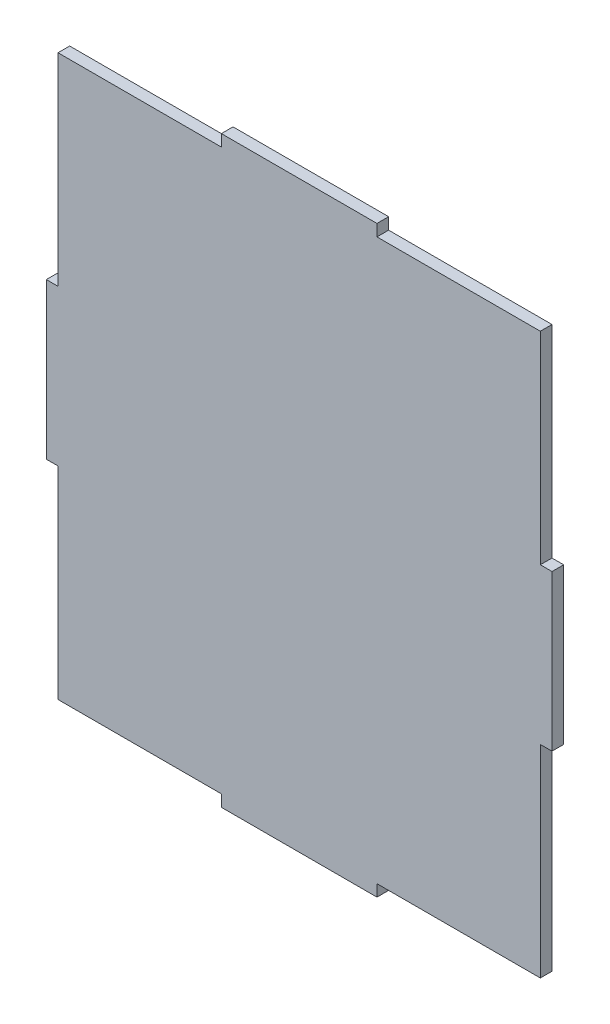
ISO-10303-21;
HEADER;
FILE_DESCRIPTION(('STEP AP214'),'2;1');
FILE_NAME('part.step','',(''),(''),'','','');
FILE_SCHEMA(('AUTOMOTIVE_DESIGN { 1 0 10303 214 1 1 1 1 }'));
ENDSEC;
DATA;
#1=APPLICATION_CONTEXT('core data for automotive mechanical design processes');
#2=APPLICATION_PROTOCOL_DEFINITION('international standard','automotive_design',2000,#1);
#3=PRODUCT_CONTEXT('',#1,'mechanical');
#4=PRODUCT('Part','Part','',(#3));
#5=PRODUCT_RELATED_PRODUCT_CATEGORY('part','',(#4));
#6=PRODUCT_DEFINITION_FORMATION('','',#4);
#7=PRODUCT_DEFINITION_CONTEXT('part definition',#1,'design');
#8=PRODUCT_DEFINITION('design','',#6,#7);
#9=PRODUCT_DEFINITION_SHAPE('','',#8);
#10=(LENGTH_UNIT() NAMED_UNIT(*) SI_UNIT(.MILLI.,.METRE.));
#11=(NAMED_UNIT(*) PLANE_ANGLE_UNIT() SI_UNIT($,.RADIAN.));
#12=(NAMED_UNIT(*) SI_UNIT($,.STERADIAN.) SOLID_ANGLE_UNIT());
#13=UNCERTAINTY_MEASURE_WITH_UNIT(LENGTH_MEASURE(1.E-05),#10,'distance_accuracy_value','');
#14=(GEOMETRIC_REPRESENTATION_CONTEXT(3) GLOBAL_UNCERTAINTY_ASSIGNED_CONTEXT((#13)) GLOBAL_UNIT_ASSIGNED_CONTEXT((#10,
#11,#12)) REPRESENTATION_CONTEXT('',''));
#15=CARTESIAN_POINT('',(0.,0.,0.));
#16=DIRECTION('',(0.,0.,1.));
#17=DIRECTION('',(1.,0.,0.));
#18=AXIS2_PLACEMENT_3D('',#15,#16,#17);
#19=CARTESIAN_POINT('',(0.,0.,0.));
#20=DIRECTION('',(0.,0.,1.));
#21=DIRECTION('',(1.,0.,0.));
#22=AXIS2_PLACEMENT_3D('',#19,#20,#21);
#23=PLANE('',#22);
#24=DIRECTION('',(0.,-1.,0.));
#25=VECTOR('',#24,1.);
#26=CARTESIAN_POINT('',(63.5465250617138,0.,0.));
#27=LINE('',#26,#25);
#28=CARTESIAN_POINT('',(63.5465250617138,66.844916460954,0.));
#29=VERTEX_POINT('',#28);
#30=CARTESIAN_POINT('',(63.5465250617138,14.844916460954,0.));
#31=VERTEX_POINT('',#30);
#32=EDGE_CURVE('E392',#29,#31,#27,.T.);
#33=ORIENTED_EDGE('',*,*,#32,.T.);
#34=DIRECTION('',(1.,0.,0.));
#35=VECTOR('',#34,1.);
#36=CARTESIAN_POINT('',(63.5465250617138,14.844916460954,0.));
#37=LINE('',#36,#35);
#38=CARTESIAN_POINT('',(66.5465250617138,14.844916460954,0.));
#39=VERTEX_POINT('',#38);
#40=EDGE_CURVE('E191',#31,#39,#37,.T.);
#41=ORIENTED_EDGE('',*,*,#40,.T.);
#42=DIRECTION('',(0.,-1.,0.));
#43=VECTOR('',#42,1.);
#44=CARTESIAN_POINT('',(66.5465250617138,14.844916460954,0.));
#45=LINE('',#44,#43);
#46=CARTESIAN_POINT('',(66.5465250617138,-25.155083539046,0.));
#47=VERTEX_POINT('',#46);
#48=EDGE_CURVE('E299',#39,#47,#45,.T.);
#49=ORIENTED_EDGE('',*,*,#48,.T.);
#50=DIRECTION('',(1.,0.,0.));
#51=VECTOR('',#50,1.);
#52=CARTESIAN_POINT('',(63.5465250617138,-25.155083539046,0.));
#53=LINE('',#52,#51);
#54=CARTESIAN_POINT('',(63.5465250617138,-25.155083539046,0.));
#55=VERTEX_POINT('',#54);
#56=EDGE_CURVE('E291',#55,#47,#53,.T.);
#57=ORIENTED_EDGE('',*,*,#56,.F.);
#58=CARTESIAN_POINT('',(63.5465250617138,-77.155083539046,0.));
#59=VERTEX_POINT('',#58);
#60=EDGE_CURVE('E254',#55,#59,#27,.T.);
#61=ORIENTED_EDGE('',*,*,#60,.T.);
#62=DIRECTION('',(1.,0.,0.));
#63=VECTOR('',#62,1.);
#64=CARTESIAN_POINT('',(0.,-77.155083539046,0.));
#65=LINE('',#64,#63);
#66=CARTESIAN_POINT('',(21.5465250617138,-77.155083539046,0.));
#67=VERTEX_POINT('',#66);
#68=EDGE_CURVE('E408',#67,#59,#65,.T.);
#69=ORIENTED_EDGE('',*,*,#68,.F.);
#70=DIRECTION('',(0.,1.,0.));
#71=VECTOR('',#70,1.);
#72=CARTESIAN_POINT('',(21.5465250617138,-80.155083539046,0.));
#73=LINE('',#72,#71);
#74=CARTESIAN_POINT('',(21.5465250617138,-80.155083539046,0.));
#75=VERTEX_POINT('',#74);
#76=EDGE_CURVE('E203',#75,#67,#73,.T.);
#77=ORIENTED_EDGE('',*,*,#76,.F.);
#78=DIRECTION('',(1.,0.,0.));
#79=VECTOR('',#78,1.);
#80=CARTESIAN_POINT('',(-18.4534749382862,-80.155083539046,0.));
#81=LINE('',#80,#79);
#82=CARTESIAN_POINT('',(-18.4534749382862,-80.155083539046,0.));
#83=VERTEX_POINT('',#82);
#84=EDGE_CURVE('E181',#83,#75,#81,.T.);
#85=ORIENTED_EDGE('',*,*,#84,.F.);
#86=DIRECTION('',(0.,1.,0.));
#87=VECTOR('',#86,1.);
#88=CARTESIAN_POINT('',(-18.4534749382862,-80.155083539046,0.));
#89=LINE('',#88,#87);
#90=CARTESIAN_POINT('',(-18.4534749382862,-77.155083539046,0.));
#91=VERTEX_POINT('',#90);
#92=EDGE_CURVE('E200',#83,#91,#89,.T.);
#93=ORIENTED_EDGE('',*,*,#92,.T.);
#94=CARTESIAN_POINT('',(-60.4534749382862,-77.155083539046,0.));
#95=VERTEX_POINT('',#94);
#96=EDGE_CURVE('E409',#95,#91,#65,.T.);
#97=ORIENTED_EDGE('',*,*,#96,.F.);
#98=DIRECTION('',(0.,-1.,0.));
#99=VECTOR('',#98,1.);
#100=CARTESIAN_POINT('',(-60.4534749382862,0.,0.));
#101=LINE('',#100,#99);
#102=CARTESIAN_POINT('',(-60.4534749382862,-25.155083539046,0.));
#103=VERTEX_POINT('',#102);
#104=EDGE_CURVE('E404',#103,#95,#101,.T.);
#105=ORIENTED_EDGE('',*,*,#104,.F.);
#106=DIRECTION('',(1.,0.,0.));
#107=VECTOR('',#106,1.);
#108=CARTESIAN_POINT('',(-63.4534749382862,-25.155083539046,0.));
#109=LINE('',#108,#107);
#110=CARTESIAN_POINT('',(-63.4534749382862,-25.155083539046,0.));
#111=VERTEX_POINT('',#110);
#112=EDGE_CURVE('E247',#111,#103,#109,.T.);
#113=ORIENTED_EDGE('',*,*,#112,.F.);
#114=DIRECTION('',(0.,-1.,0.));
#115=VECTOR('',#114,1.);
#116=CARTESIAN_POINT('',(-63.4534749382862,14.844916460954,0.));
#117=LINE('',#116,#115);
#118=CARTESIAN_POINT('',(-63.4534749382862,14.844916460954,0.));
#119=VERTEX_POINT('',#118);
#120=EDGE_CURVE('E238',#119,#111,#117,.T.);
#121=ORIENTED_EDGE('',*,*,#120,.F.);
#122=DIRECTION('',(1.,0.,0.));
#123=VECTOR('',#122,1.);
#124=CARTESIAN_POINT('',(-63.4534749382862,14.844916460954,0.));
#125=LINE('',#124,#123);
#126=CARTESIAN_POINT('',(-60.4534749382862,14.844916460954,0.));
#127=VERTEX_POINT('',#126);
#128=EDGE_CURVE('E244',#119,#127,#125,.T.);
#129=ORIENTED_EDGE('',*,*,#128,.T.);
#130=CARTESIAN_POINT('',(-60.4534749382862,66.844916460954,0.));
#131=VERTEX_POINT('',#130);
#132=EDGE_CURVE('E405',#131,#127,#101,.T.);
#133=ORIENTED_EDGE('',*,*,#132,.F.);
#134=DIRECTION('',(1.,0.,0.));
#135=VECTOR('',#134,1.);
#136=CARTESIAN_POINT('',(0.,66.844916460954,0.));
#137=LINE('',#136,#135);
#138=CARTESIAN_POINT('',(-18.4534749382862,66.844916460954,0.));
#139=VERTEX_POINT('',#138);
#140=EDGE_CURVE('E396',#131,#139,#137,.T.);
#141=ORIENTED_EDGE('',*,*,#140,.T.);
#142=DIRECTION('',(0.,-1.,0.));
#143=VECTOR('',#142,1.);
#144=CARTESIAN_POINT('',(-18.4534749382862,69.844916460954,0.));
#145=LINE('',#144,#143);
#146=CARTESIAN_POINT('',(-18.4534749382862,69.844916460954,0.));
#147=VERTEX_POINT('',#146);
#148=EDGE_CURVE('E271',#147,#139,#145,.T.);
#149=ORIENTED_EDGE('',*,*,#148,.F.);
#150=DIRECTION('',(1.,0.,0.));
#151=VECTOR('',#150,1.);
#152=CARTESIAN_POINT('',(-18.4534749382862,69.844916460954,0.));
#153=LINE('',#152,#151);
#154=CARTESIAN_POINT('',(21.5465250617138,69.844916460954,0.));
#155=VERTEX_POINT('',#154);
#156=EDGE_CURVE('E264',#147,#155,#153,.T.);
#157=ORIENTED_EDGE('',*,*,#156,.T.);
#158=DIRECTION('',(0.,-1.,0.));
#159=VECTOR('',#158,1.);
#160=CARTESIAN_POINT('',(21.5465250617138,69.844916460954,0.));
#161=LINE('',#160,#159);
#162=CARTESIAN_POINT('',(21.5465250617138,66.844916460954,0.));
#163=VERTEX_POINT('',#162);
#164=EDGE_CURVE('E274',#155,#163,#161,.T.);
#165=ORIENTED_EDGE('',*,*,#164,.T.);
#166=EDGE_CURVE('E393',#163,#29,#137,.T.);
#167=ORIENTED_EDGE('',*,*,#166,.T.);
#168=EDGE_LOOP('',(#33,#41,#49,#57,#61,#69,#77,#85,#93,#97,#105,#113,#121,#129,#133,#141,#149,
#157,#165,#167));
#169=FACE_BOUND('',#168,.T.);
#170=ADVANCED_FACE('F107',(#169),#23,.F.);
#171=CARTESIAN_POINT('',(-60.4534749382862,0.,3.));
#172=DIRECTION('',(1.,0.,0.));
#173=DIRECTION('',(0.,1.,0.));
#174=AXIS2_PLACEMENT_3D('',#171,#172,#173);
#175=PLANE('',#174);
#176=DIRECTION('',(0.,0.,-1.));
#177=VECTOR('',#176,1.);
#178=CARTESIAN_POINT('',(-60.4534749382862,14.844916460954,3.));
#179=LINE('',#178,#177);
#180=CARTESIAN_POINT('',(-60.4534749382862,14.844916460954,3.));
#181=VERTEX_POINT('',#180);
#182=EDGE_CURVE('E212',#181,#127,#179,.T.);
#183=ORIENTED_EDGE('',*,*,#182,.F.);
#184=DIRECTION('',(0.,-1.,0.));
#185=VECTOR('',#184,1.);
#186=CARTESIAN_POINT('',(-60.4534749382862,0.,3.));
#187=LINE('',#186,#185);
#188=CARTESIAN_POINT('',(-60.4534749382862,66.844916460954,3.));
#189=VERTEX_POINT('',#188);
#190=EDGE_CURVE('E447',#189,#181,#187,.T.);
#191=ORIENTED_EDGE('',*,*,#190,.F.);
#192=DIRECTION('',(0.,0.,-1.));
#193=VECTOR('',#192,1.);
#194=CARTESIAN_POINT('',(-60.4534749382862,66.844916460954,3.));
#195=LINE('',#194,#193);
#196=EDGE_CURVE('E222',#189,#131,#195,.T.);
#197=ORIENTED_EDGE('',*,*,#196,.T.);
#198=ORIENTED_EDGE('',*,*,#132,.T.);
#199=EDGE_LOOP('',(#183,#191,#197,#198));
#200=FACE_BOUND('',#199,.T.);
#201=ADVANCED_FACE('F324',(#200),#175,.F.);
#202=CARTESIAN_POINT('',(-60.4534749382862,-25.155083539046,3.));
#203=VERTEX_POINT('',#202);
#204=CARTESIAN_POINT('',(-60.4534749382862,-77.155083539046,3.));
#205=VERTEX_POINT('',#204);
#206=EDGE_CURVE('E435',#203,#205,#187,.T.);
#207=ORIENTED_EDGE('',*,*,#206,.F.);
#208=DIRECTION('',(0.,0.,-1.));
#209=VECTOR('',#208,1.);
#210=CARTESIAN_POINT('',(-60.4534749382862,-25.155083539046,3.));
#211=LINE('',#210,#209);
#212=EDGE_CURVE('E218',#203,#103,#211,.T.);
#213=ORIENTED_EDGE('',*,*,#212,.T.);
#214=ORIENTED_EDGE('',*,*,#104,.T.);
#215=DIRECTION('',(0.,0.,-1.));
#216=VECTOR('',#215,1.);
#217=CARTESIAN_POINT('',(-60.4534749382862,-77.155083539046,3.));
#218=LINE('',#217,#216);
#219=EDGE_CURVE('E230',#205,#95,#218,.T.);
#220=ORIENTED_EDGE('',*,*,#219,.F.);
#221=EDGE_LOOP('',(#207,#213,#214,#220));
#222=FACE_BOUND('',#221,.T.);
#223=ADVANCED_FACE('F326',(#222),#175,.F.);
#224=CARTESIAN_POINT('',(0.,-77.155083539046,3.));
#225=DIRECTION('',(0.,1.,0.));
#226=DIRECTION('',(0.,0.,1.));
#227=AXIS2_PLACEMENT_3D('',#224,#225,#226);
#228=PLANE('',#227);
#229=DIRECTION('',(1.,0.,0.));
#230=VECTOR('',#229,1.);
#231=CARTESIAN_POINT('',(0.,-77.155083539046,3.));
#232=LINE('',#231,#230);
#233=CARTESIAN_POINT('',(21.5465250617138,-77.155083539046,3.));
#234=VERTEX_POINT('',#233);
#235=CARTESIAN_POINT('',(63.5465250617138,-77.155083539046,3.));
#236=VERTEX_POINT('',#235);
#237=EDGE_CURVE('E486',#234,#236,#232,.T.);
#238=ORIENTED_EDGE('',*,*,#237,.F.);
#239=DIRECTION('',(0.,0.,-1.));
#240=VECTOR('',#239,1.);
#241=CARTESIAN_POINT('',(21.5465250617138,-77.155083539046,3.));
#242=LINE('',#241,#240);
#243=EDGE_CURVE('E126',#234,#67,#242,.T.);
#244=ORIENTED_EDGE('',*,*,#243,.T.);
#245=ORIENTED_EDGE('',*,*,#68,.T.);
#246=DIRECTION('',(0.,0.,-1.));
#247=VECTOR('',#246,1.);
#248=CARTESIAN_POINT('',(63.5465250617138,-77.155083539046,3.));
#249=LINE('',#248,#247);
#250=EDGE_CURVE('E412',#236,#59,#249,.T.);
#251=ORIENTED_EDGE('',*,*,#250,.F.);
#252=EDGE_LOOP('',(#238,#244,#245,#251));
#253=FACE_BOUND('',#252,.T.);
#254=ADVANCED_FACE('F321',(#253),#228,.F.);
#255=CARTESIAN_POINT('',(63.5465250617138,0.,3.));
#256=DIRECTION('',(1.,0.,0.));
#257=DIRECTION('',(0.,1.,0.));
#258=AXIS2_PLACEMENT_3D('',#255,#256,#257);
#259=PLANE('',#258);
#260=DIRECTION('',(0.,0.,-1.));
#261=VECTOR('',#260,1.);
#262=CARTESIAN_POINT('',(63.5465250617138,-25.155083539046,3.));
#263=LINE('',#262,#261);
#264=CARTESIAN_POINT('',(63.5465250617138,-25.155083539046,3.));
#265=VERTEX_POINT('',#264);
#266=EDGE_CURVE('E117',#265,#55,#263,.T.);
#267=ORIENTED_EDGE('',*,*,#266,.F.);
#268=DIRECTION('',(0.,-1.,0.));
#269=VECTOR('',#268,1.);
#270=CARTESIAN_POINT('',(63.5465250617138,0.,3.));
#271=LINE('',#270,#269);
#272=EDGE_CURVE('E411',#265,#236,#271,.T.);
#273=ORIENTED_EDGE('',*,*,#272,.T.);
#274=ORIENTED_EDGE('',*,*,#250,.T.);
#275=ORIENTED_EDGE('',*,*,#60,.F.);
#276=EDGE_LOOP('',(#267,#273,#274,#275));
#277=FACE_BOUND('',#276,.T.);
#278=ADVANCED_FACE('F343',(#277),#259,.T.);
#279=CARTESIAN_POINT('',(0.,66.844916460954,3.));
#280=DIRECTION('',(0.,1.,0.));
#281=DIRECTION('',(0.,0.,1.));
#282=AXIS2_PLACEMENT_3D('',#279,#280,#281);
#283=PLANE('',#282);
#284=DIRECTION('',(0.,0.,-1.));
#285=VECTOR('',#284,1.);
#286=CARTESIAN_POINT('',(21.5465250617138,66.844916460954,3.));
#287=LINE('',#286,#285);
#288=CARTESIAN_POINT('',(21.5465250617138,66.844916460954,3.));
#289=VERTEX_POINT('',#288);
#290=EDGE_CURVE('E282',#289,#163,#287,.T.);
#291=ORIENTED_EDGE('',*,*,#290,.F.);
#292=DIRECTION('',(1.,0.,0.));
#293=VECTOR('',#292,1.);
#294=CARTESIAN_POINT('',(0.,66.844916460954,3.));
#295=LINE('',#294,#293);
#296=CARTESIAN_POINT('',(63.5465250617138,66.844916460954,3.));
#297=VERTEX_POINT('',#296);
#298=EDGE_CURVE('E476',#289,#297,#295,.T.);
#299=ORIENTED_EDGE('',*,*,#298,.T.);
#300=DIRECTION('',(0.,0.,-1.));
#301=VECTOR('',#300,1.);
#302=CARTESIAN_POINT('',(63.5465250617138,66.844916460954,3.));
#303=LINE('',#302,#301);
#304=EDGE_CURVE('E220',#297,#29,#303,.T.);
#305=ORIENTED_EDGE('',*,*,#304,.T.);
#306=ORIENTED_EDGE('',*,*,#166,.F.);
#307=EDGE_LOOP('',(#291,#299,#305,#306));
#308=FACE_BOUND('',#307,.T.);
#309=ADVANCED_FACE('F339',(#308),#283,.T.);
#310=CARTESIAN_POINT('',(-18.4534749382862,66.844916460954,3.));
#311=VERTEX_POINT('',#310);
#312=EDGE_CURVE('E478',#189,#311,#295,.T.);
#313=ORIENTED_EDGE('',*,*,#312,.T.);
#314=DIRECTION('',(0.,0.,-1.));
#315=VECTOR('',#314,1.);
#316=CARTESIAN_POINT('',(-18.4534749382862,66.844916460954,3.));
#317=LINE('',#316,#315);
#318=EDGE_CURVE('E258',#311,#139,#317,.T.);
#319=ORIENTED_EDGE('',*,*,#318,.T.);
#320=ORIENTED_EDGE('',*,*,#140,.F.);
#321=ORIENTED_EDGE('',*,*,#196,.F.);
#322=EDGE_LOOP('',(#313,#319,#320,#321));
#323=FACE_BOUND('',#322,.T.);
#324=ADVANCED_FACE('F342',(#323),#283,.T.);
#325=DIRECTION('',(0.,0.,-1.));
#326=VECTOR('',#325,1.);
#327=CARTESIAN_POINT('',(-18.4534749382862,-77.155083539046,3.));
#328=LINE('',#327,#326);
#329=CARTESIAN_POINT('',(-18.4534749382862,-77.155083539046,3.));
#330=VERTEX_POINT('',#329);
#331=EDGE_CURVE('E111',#330,#91,#328,.T.);
#332=ORIENTED_EDGE('',*,*,#331,.F.);
#333=EDGE_CURVE('E400',#205,#330,#232,.T.);
#334=ORIENTED_EDGE('',*,*,#333,.F.);
#335=ORIENTED_EDGE('',*,*,#219,.T.);
#336=ORIENTED_EDGE('',*,*,#96,.T.);
#337=EDGE_LOOP('',(#332,#334,#335,#336));
#338=FACE_BOUND('',#337,.T.);
#339=ADVANCED_FACE('F419',(#338),#228,.F.);
#340=CARTESIAN_POINT('',(63.5465250617138,14.844916460954,3.));
#341=VERTEX_POINT('',#340);
#342=EDGE_CURVE('E479',#297,#341,#271,.T.);
#343=ORIENTED_EDGE('',*,*,#342,.T.);
#344=DIRECTION('',(0.,0.,-1.));
#345=VECTOR('',#344,1.);
#346=CARTESIAN_POINT('',(63.5465250617138,14.844916460954,3.));
#347=LINE('',#346,#345);
#348=EDGE_CURVE('E12',#341,#31,#347,.T.);
#349=ORIENTED_EDGE('',*,*,#348,.T.);
#350=ORIENTED_EDGE('',*,*,#32,.F.);
#351=ORIENTED_EDGE('',*,*,#304,.F.);
#352=EDGE_LOOP('',(#343,#349,#350,#351));
#353=FACE_BOUND('',#352,.T.);
#354=ADVANCED_FACE('F349',(#353),#259,.T.);
#355=CARTESIAN_POINT('',(0.,0.,3.));
#356=DIRECTION('',(0.,0.,1.));
#357=DIRECTION('',(1.,0.,0.));
#358=AXIS2_PLACEMENT_3D('',#355,#356,#357);
#359=PLANE('',#358);
#360=ORIENTED_EDGE('',*,*,#342,.F.);
#361=ORIENTED_EDGE('',*,*,#298,.F.);
#362=DIRECTION('',(0.,-1.,0.));
#363=VECTOR('',#362,1.);
#364=CARTESIAN_POINT('',(21.5465250617138,69.844916460954,3.));
#365=LINE('',#364,#363);
#366=CARTESIAN_POINT('',(21.5465250617138,69.844916460954,3.));
#367=VERTEX_POINT('',#366);
#368=EDGE_CURVE('E263',#367,#289,#365,.T.);
#369=ORIENTED_EDGE('',*,*,#368,.F.);
#370=DIRECTION('',(1.,0.,0.));
#371=VECTOR('',#370,1.);
#372=CARTESIAN_POINT('',(-18.4534749382862,69.844916460954,3.));
#373=LINE('',#372,#371);
#374=CARTESIAN_POINT('',(-18.4534749382862,69.844916460954,3.));
#375=VERTEX_POINT('',#374);
#376=EDGE_CURVE('E267',#375,#367,#373,.T.);
#377=ORIENTED_EDGE('',*,*,#376,.F.);
#378=DIRECTION('',(0.,-1.,0.));
#379=VECTOR('',#378,1.);
#380=CARTESIAN_POINT('',(-18.4534749382862,69.844916460954,3.));
#381=LINE('',#380,#379);
#382=EDGE_CURVE('E260',#375,#311,#381,.T.);
#383=ORIENTED_EDGE('',*,*,#382,.T.);
#384=ORIENTED_EDGE('',*,*,#312,.F.);
#385=ORIENTED_EDGE('',*,*,#190,.T.);
#386=DIRECTION('',(1.,0.,0.));
#387=VECTOR('',#386,1.);
#388=CARTESIAN_POINT('',(-63.4534749382862,14.844916460954,3.));
#389=LINE('',#388,#387);
#390=CARTESIAN_POINT('',(-63.4534749382862,14.844916460954,3.));
#391=VERTEX_POINT('',#390);
#392=EDGE_CURVE('E234',#391,#181,#389,.T.);
#393=ORIENTED_EDGE('',*,*,#392,.F.);
#394=DIRECTION('',(0.,-1.,0.));
#395=VECTOR('',#394,1.);
#396=CARTESIAN_POINT('',(-63.4534749382862,14.844916460954,3.));
#397=LINE('',#396,#395);
#398=CARTESIAN_POINT('',(-63.4534749382862,-25.155083539046,3.));
#399=VERTEX_POINT('',#398);
#400=EDGE_CURVE('E241',#391,#399,#397,.T.);
#401=ORIENTED_EDGE('',*,*,#400,.T.);
#402=DIRECTION('',(1.,0.,0.));
#403=VECTOR('',#402,1.);
#404=CARTESIAN_POINT('',(-63.4534749382862,-25.155083539046,3.));
#405=LINE('',#404,#403);
#406=EDGE_CURVE('E237',#399,#203,#405,.T.);
#407=ORIENTED_EDGE('',*,*,#406,.T.);
#408=ORIENTED_EDGE('',*,*,#206,.T.);
#409=ORIENTED_EDGE('',*,*,#333,.T.);
#410=DIRECTION('',(0.,1.,0.));
#411=VECTOR('',#410,1.);
#412=CARTESIAN_POINT('',(-18.4534749382862,-80.155083539046,3.));
#413=LINE('',#412,#411);
#414=CARTESIAN_POINT('',(-18.4534749382862,-80.155083539046,3.));
#415=VERTEX_POINT('',#414);
#416=EDGE_CURVE('E204',#415,#330,#413,.T.);
#417=ORIENTED_EDGE('',*,*,#416,.F.);
#418=DIRECTION('',(1.,0.,0.));
#419=VECTOR('',#418,1.);
#420=CARTESIAN_POINT('',(-18.4534749382862,-80.155083539046,3.));
#421=LINE('',#420,#419);
#422=CARTESIAN_POINT('',(21.5465250617138,-80.155083539046,3.));
#423=VERTEX_POINT('',#422);
#424=EDGE_CURVE('E186',#415,#423,#421,.T.);
#425=ORIENTED_EDGE('',*,*,#424,.T.);
#426=DIRECTION('',(0.,1.,0.));
#427=VECTOR('',#426,1.);
#428=CARTESIAN_POINT('',(21.5465250617138,-80.155083539046,3.));
#429=LINE('',#428,#427);
#430=EDGE_CURVE('E308',#423,#234,#429,.T.);
#431=ORIENTED_EDGE('',*,*,#430,.T.);
#432=ORIENTED_EDGE('',*,*,#237,.T.);
#433=ORIENTED_EDGE('',*,*,#272,.F.);
#434=DIRECTION('',(1.,0.,0.));
#435=VECTOR('',#434,1.);
#436=CARTESIAN_POINT('',(63.5465250617138,-25.155083539046,3.));
#437=LINE('',#436,#435);
#438=CARTESIAN_POINT('',(66.5465250617138,-25.155083539046,3.));
#439=VERTEX_POINT('',#438);
#440=EDGE_CURVE('E294',#265,#439,#437,.T.);
#441=ORIENTED_EDGE('',*,*,#440,.T.);
#442=DIRECTION('',(0.,-1.,0.));
#443=VECTOR('',#442,1.);
#444=CARTESIAN_POINT('',(66.5465250617138,14.844916460954,3.));
#445=LINE('',#444,#443);
#446=CARTESIAN_POINT('',(66.5465250617138,14.844916460954,3.));
#447=VERTEX_POINT('',#446);
#448=EDGE_CURVE('E290',#447,#439,#445,.T.);
#449=ORIENTED_EDGE('',*,*,#448,.F.);
#450=DIRECTION('',(1.,0.,0.));
#451=VECTOR('',#450,1.);
#452=CARTESIAN_POINT('',(63.5465250617138,14.844916460954,3.));
#453=LINE('',#452,#451);
#454=EDGE_CURVE('E287',#341,#447,#453,.T.);
#455=ORIENTED_EDGE('',*,*,#454,.F.);
#456=EDGE_LOOP('',(#360,#361,#369,#377,#383,#384,#385,#393,#401,#407,#408,#409,#417,#425,#431,
#432,#433,#441,#449,#455));
#457=FACE_BOUND('',#456,.T.);
#458=ADVANCED_FACE('F312',(#457),#359,.T.);
#459=CARTESIAN_POINT('',(-63.4534749382862,14.844916460954,3.));
#460=DIRECTION('',(1.,0.,0.));
#461=DIRECTION('',(0.,0.,-1.));
#462=AXIS2_PLACEMENT_3D('',#459,#460,#461);
#463=PLANE('',#462);
#464=ORIENTED_EDGE('',*,*,#120,.T.);
#465=DIRECTION('',(0.,0.,-1.));
#466=VECTOR('',#465,1.);
#467=CARTESIAN_POINT('',(-63.4534749382862,-25.155083539046,3.));
#468=LINE('',#467,#466);
#469=EDGE_CURVE('E243',#399,#111,#468,.T.);
#470=ORIENTED_EDGE('',*,*,#469,.F.);
#471=ORIENTED_EDGE('',*,*,#400,.F.);
#472=DIRECTION('',(0.,0.,-1.));
#473=VECTOR('',#472,1.);
#474=CARTESIAN_POINT('',(-63.4534749382862,14.844916460954,3.));
#475=LINE('',#474,#473);
#476=EDGE_CURVE('E252',#391,#119,#475,.T.);
#477=ORIENTED_EDGE('',*,*,#476,.T.);
#478=EDGE_LOOP('',(#464,#470,#471,#477));
#479=FACE_BOUND('',#478,.T.);
#480=ADVANCED_FACE('F334',(#479),#463,.F.);
#481=CARTESIAN_POINT('',(-63.4534749382862,-25.155083539046,3.));
#482=DIRECTION('',(0.,1.,0.));
#483=DIRECTION('',(0.,0.,1.));
#484=AXIS2_PLACEMENT_3D('',#481,#482,#483);
#485=PLANE('',#484);
#486=ORIENTED_EDGE('',*,*,#112,.T.);
#487=ORIENTED_EDGE('',*,*,#212,.F.);
#488=ORIENTED_EDGE('',*,*,#406,.F.);
#489=ORIENTED_EDGE('',*,*,#469,.T.);
#490=EDGE_LOOP('',(#486,#487,#488,#489));
#491=FACE_BOUND('',#490,.T.);
#492=ADVANCED_FACE('F352',(#491),#485,.F.);
#493=CARTESIAN_POINT('',(-63.4534749382862,14.844916460954,3.));
#494=DIRECTION('',(0.,1.,0.));
#495=DIRECTION('',(0.,0.,1.));
#496=AXIS2_PLACEMENT_3D('',#493,#494,#495);
#497=PLANE('',#496);
#498=ORIENTED_EDGE('',*,*,#128,.F.);
#499=ORIENTED_EDGE('',*,*,#476,.F.);
#500=ORIENTED_EDGE('',*,*,#392,.T.);
#501=ORIENTED_EDGE('',*,*,#182,.T.);
#502=EDGE_LOOP('',(#498,#499,#500,#501));
#503=FACE_BOUND('',#502,.T.);
#504=ADVANCED_FACE('F322',(#503),#497,.T.);
#505=CARTESIAN_POINT('',(-18.4534749382862,-80.155083539046,3.));
#506=DIRECTION('',(0.,1.,0.));
#507=DIRECTION('',(0.,0.,1.));
#508=AXIS2_PLACEMENT_3D('',#505,#506,#507);
#509=PLANE('',#508);
#510=ORIENTED_EDGE('',*,*,#84,.T.);
#511=DIRECTION('',(0.,0.,-1.));
#512=VECTOR('',#511,1.);
#513=CARTESIAN_POINT('',(21.5465250617138,-80.155083539046,3.));
#514=LINE('',#513,#512);
#515=EDGE_CURVE('E192',#423,#75,#514,.T.);
#516=ORIENTED_EDGE('',*,*,#515,.F.);
#517=ORIENTED_EDGE('',*,*,#424,.F.);
#518=DIRECTION('',(0.,0.,-1.));
#519=VECTOR('',#518,1.);
#520=CARTESIAN_POINT('',(-18.4534749382862,-80.155083539046,3.));
#521=LINE('',#520,#519);
#522=EDGE_CURVE('E184',#415,#83,#521,.T.);
#523=ORIENTED_EDGE('',*,*,#522,.T.);
#524=EDGE_LOOP('',(#510,#516,#517,#523));
#525=FACE_BOUND('',#524,.T.);
#526=ADVANCED_FACE('F185',(#525),#509,.F.);
#527=CARTESIAN_POINT('',(21.5465250617138,-80.155083539046,3.));
#528=DIRECTION('',(-1.,0.,0.));
#529=DIRECTION('',(0.,0.,1.));
#530=AXIS2_PLACEMENT_3D('',#527,#528,#529);
#531=PLANE('',#530);
#532=ORIENTED_EDGE('',*,*,#76,.T.);
#533=ORIENTED_EDGE('',*,*,#243,.F.);
#534=ORIENTED_EDGE('',*,*,#430,.F.);
#535=ORIENTED_EDGE('',*,*,#515,.T.);
#536=EDGE_LOOP('',(#532,#533,#534,#535));
#537=FACE_BOUND('',#536,.T.);
#538=ADVANCED_FACE('F314',(#537),#531,.F.);
#539=CARTESIAN_POINT('',(-18.4534749382862,-80.155083539046,3.));
#540=DIRECTION('',(-1.,0.,0.));
#541=DIRECTION('',(0.,0.,1.));
#542=AXIS2_PLACEMENT_3D('',#539,#540,#541);
#543=PLANE('',#542);
#544=ORIENTED_EDGE('',*,*,#92,.F.);
#545=ORIENTED_EDGE('',*,*,#522,.F.);
#546=ORIENTED_EDGE('',*,*,#416,.T.);
#547=ORIENTED_EDGE('',*,*,#331,.T.);
#548=EDGE_LOOP('',(#544,#545,#546,#547));
#549=FACE_BOUND('',#548,.T.);
#550=ADVANCED_FACE('F109',(#549),#543,.T.);
#551=CARTESIAN_POINT('',(63.5465250617138,-25.155083539046,3.));
#552=DIRECTION('',(0.,1.,0.));
#553=DIRECTION('',(0.,0.,1.));
#554=AXIS2_PLACEMENT_3D('',#551,#552,#553);
#555=PLANE('',#554);
#556=ORIENTED_EDGE('',*,*,#56,.T.);
#557=DIRECTION('',(0.,0.,-1.));
#558=VECTOR('',#557,1.);
#559=CARTESIAN_POINT('',(66.5465250617138,-25.155083539046,3.));
#560=LINE('',#559,#558);
#561=EDGE_CURVE('E275',#439,#47,#560,.T.);
#562=ORIENTED_EDGE('',*,*,#561,.F.);
#563=ORIENTED_EDGE('',*,*,#440,.F.);
#564=ORIENTED_EDGE('',*,*,#266,.T.);
#565=EDGE_LOOP('',(#556,#562,#563,#564));
#566=FACE_BOUND('',#565,.T.);
#567=ADVANCED_FACE('F320',(#566),#555,.F.);
#568=CARTESIAN_POINT('',(66.5465250617138,14.844916460954,3.));
#569=DIRECTION('',(1.,0.,0.));
#570=DIRECTION('',(0.,0.,-1.));
#571=AXIS2_PLACEMENT_3D('',#568,#569,#570);
#572=PLANE('',#571);
#573=ORIENTED_EDGE('',*,*,#48,.F.);
#574=DIRECTION('',(0.,0.,-1.));
#575=VECTOR('',#574,1.);
#576=CARTESIAN_POINT('',(66.5465250617138,14.844916460954,3.));
#577=LINE('',#576,#575);
#578=EDGE_CURVE('E296',#447,#39,#577,.T.);
#579=ORIENTED_EDGE('',*,*,#578,.F.);
#580=ORIENTED_EDGE('',*,*,#448,.T.);
#581=ORIENTED_EDGE('',*,*,#561,.T.);
#582=EDGE_LOOP('',(#573,#579,#580,#581));
#583=FACE_BOUND('',#582,.T.);
#584=ADVANCED_FACE('F373',(#583),#572,.T.);
#585=CARTESIAN_POINT('',(63.5465250617138,14.844916460954,3.));
#586=DIRECTION('',(0.,1.,0.));
#587=DIRECTION('',(0.,0.,1.));
#588=AXIS2_PLACEMENT_3D('',#585,#586,#587);
#589=PLANE('',#588);
#590=ORIENTED_EDGE('',*,*,#40,.F.);
#591=ORIENTED_EDGE('',*,*,#348,.F.);
#592=ORIENTED_EDGE('',*,*,#454,.T.);
#593=ORIENTED_EDGE('',*,*,#578,.T.);
#594=EDGE_LOOP('',(#590,#591,#592,#593));
#595=FACE_BOUND('',#594,.T.);
#596=ADVANCED_FACE('F345',(#595),#589,.T.);
#597=CARTESIAN_POINT('',(21.5465250617138,69.844916460954,3.));
#598=DIRECTION('',(1.,0.,0.));
#599=DIRECTION('',(0.,0.,-1.));
#600=AXIS2_PLACEMENT_3D('',#597,#598,#599);
#601=PLANE('',#600);
#602=ORIENTED_EDGE('',*,*,#164,.F.);
#603=DIRECTION('',(0.,0.,-1.));
#604=VECTOR('',#603,1.);
#605=CARTESIAN_POINT('',(21.5465250617138,69.844916460954,3.));
#606=LINE('',#605,#604);
#607=EDGE_CURVE('E248',#367,#155,#606,.T.);
#608=ORIENTED_EDGE('',*,*,#607,.F.);
#609=ORIENTED_EDGE('',*,*,#368,.T.);
#610=ORIENTED_EDGE('',*,*,#290,.T.);
#611=EDGE_LOOP('',(#602,#608,#609,#610));
#612=FACE_BOUND('',#611,.T.);
#613=ADVANCED_FACE('F344',(#612),#601,.T.);
#614=CARTESIAN_POINT('',(-18.4534749382862,69.844916460954,3.));
#615=DIRECTION('',(0.,1.,0.));
#616=DIRECTION('',(0.,0.,1.));
#617=AXIS2_PLACEMENT_3D('',#614,#615,#616);
#618=PLANE('',#617);
#619=ORIENTED_EDGE('',*,*,#156,.F.);
#620=DIRECTION('',(0.,0.,-1.));
#621=VECTOR('',#620,1.);
#622=CARTESIAN_POINT('',(-18.4534749382862,69.844916460954,3.));
#623=LINE('',#622,#621);
#624=EDGE_CURVE('E270',#375,#147,#623,.T.);
#625=ORIENTED_EDGE('',*,*,#624,.F.);
#626=ORIENTED_EDGE('',*,*,#376,.T.);
#627=ORIENTED_EDGE('',*,*,#607,.T.);
#628=EDGE_LOOP('',(#619,#625,#626,#627));
#629=FACE_BOUND('',#628,.T.);
#630=ADVANCED_FACE('F360',(#629),#618,.T.);
#631=CARTESIAN_POINT('',(-18.4534749382862,69.844916460954,3.));
#632=DIRECTION('',(1.,0.,0.));
#633=DIRECTION('',(0.,0.,-1.));
#634=AXIS2_PLACEMENT_3D('',#631,#632,#633);
#635=PLANE('',#634);
#636=ORIENTED_EDGE('',*,*,#148,.T.);
#637=ORIENTED_EDGE('',*,*,#318,.F.);
#638=ORIENTED_EDGE('',*,*,#382,.F.);
#639=ORIENTED_EDGE('',*,*,#624,.T.);
#640=EDGE_LOOP('',(#636,#637,#638,#639));
#641=FACE_BOUND('',#640,.T.);
#642=ADVANCED_FACE('F363',(#641),#635,.F.);
#643=CLOSED_SHELL('',(#170,#201,#223,#254,#278,#309,#324,#339,#354,#458,#480,#492,#504,#526,
#538,#550,#567,#584,#596,#613,#630,#642));
#644=MANIFOLD_SOLID_BREP('B2',#643);
#645=ADVANCED_BREP_SHAPE_REPRESENTATION('',(#18,#644),#14);
#646=SHAPE_DEFINITION_REPRESENTATION(#9,#645);
ENDSEC;
END-ISO-10303-21;
